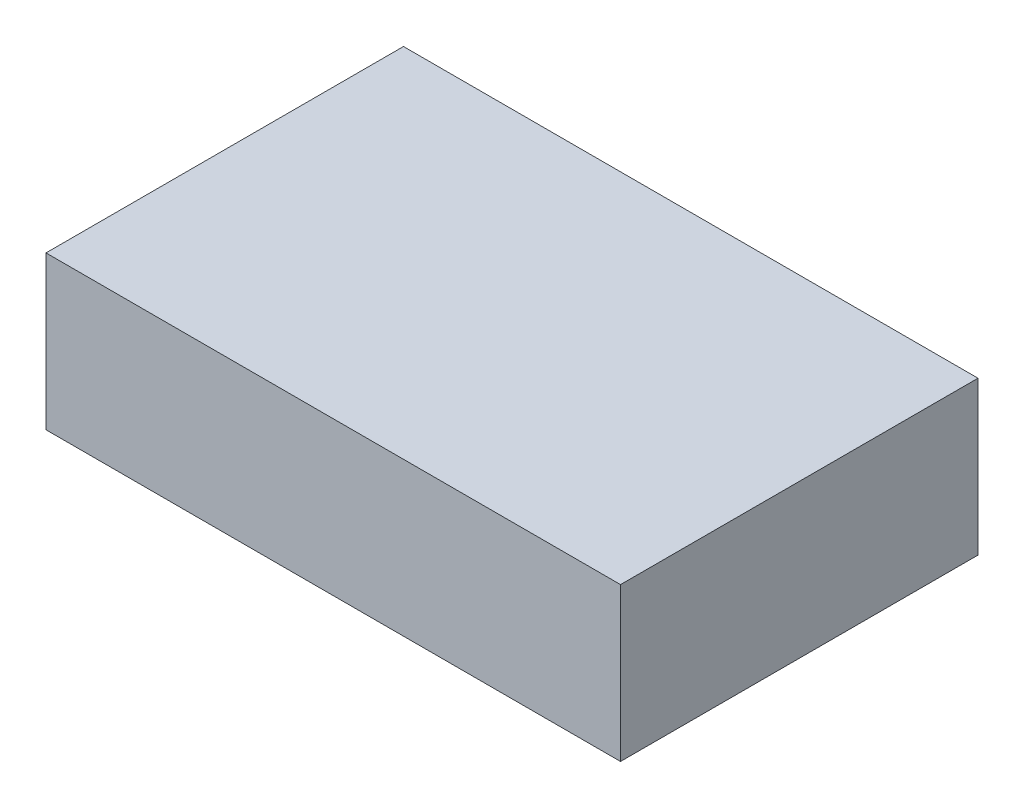
ISO-10303-21;
HEADER;
FILE_DESCRIPTION(('STEP AP214'),'2;1');
FILE_NAME('part.step','',(''),(''),'','','');
FILE_SCHEMA(('AUTOMOTIVE_DESIGN { 1 0 10303 214 1 1 1 1 }'));
ENDSEC;
DATA;
#1=APPLICATION_CONTEXT('core data for automotive mechanical design processes');
#2=APPLICATION_PROTOCOL_DEFINITION('international standard','automotive_design',2000,#1);
#3=PRODUCT_CONTEXT('',#1,'mechanical');
#4=PRODUCT('Part','Part','',(#3));
#5=PRODUCT_RELATED_PRODUCT_CATEGORY('part','',(#4));
#6=PRODUCT_DEFINITION_FORMATION('','',#4);
#7=PRODUCT_DEFINITION_CONTEXT('part definition',#1,'design');
#8=PRODUCT_DEFINITION('design','',#6,#7);
#9=PRODUCT_DEFINITION_SHAPE('','',#8);
#10=(LENGTH_UNIT() NAMED_UNIT(*) SI_UNIT(.MILLI.,.METRE.));
#11=(NAMED_UNIT(*) PLANE_ANGLE_UNIT() SI_UNIT($,.RADIAN.));
#12=(NAMED_UNIT(*) SI_UNIT($,.STERADIAN.) SOLID_ANGLE_UNIT());
#13=UNCERTAINTY_MEASURE_WITH_UNIT(LENGTH_MEASURE(1.E-05),#10,'distance_accuracy_value','');
#14=(GEOMETRIC_REPRESENTATION_CONTEXT(3) GLOBAL_UNCERTAINTY_ASSIGNED_CONTEXT((#13)) GLOBAL_UNIT_ASSIGNED_CONTEXT((#10,
#11,#12)) REPRESENTATION_CONTEXT('',''));
#15=CARTESIAN_POINT('',(0.,0.,0.));
#16=DIRECTION('',(0.,0.,1.));
#17=DIRECTION('',(1.,0.,0.));
#18=AXIS2_PLACEMENT_3D('',#15,#16,#17);
#19=CARTESIAN_POINT('',(45.,24.,-28.));
#20=DIRECTION('',(-1.,0.,0.));
#21=DIRECTION('',(0.,0.,1.));
#22=AXIS2_PLACEMENT_3D('',#19,#20,#21);
#23=PLANE('',#22);
#24=DIRECTION('',(0.,0.,-1.));
#25=VECTOR('',#24,1.);
#26=CARTESIAN_POINT('',(45.,0.,-28.));
#27=LINE('',#26,#25);
#28=CARTESIAN_POINT('',(45.,0.,28.));
#29=VERTEX_POINT('',#28);
#30=CARTESIAN_POINT('',(45.,0.,-28.));
#31=VERTEX_POINT('',#30);
#32=EDGE_CURVE('E101',#29,#31,#27,.T.);
#33=ORIENTED_EDGE('',*,*,#32,.T.);
#34=DIRECTION('',(0.,-1.,0.));
#35=VECTOR('',#34,1.);
#36=CARTESIAN_POINT('',(45.,24.,-28.));
#37=LINE('',#36,#35);
#38=CARTESIAN_POINT('',(45.,24.,-28.));
#39=VERTEX_POINT('',#38);
#40=EDGE_CURVE('E11',#39,#31,#37,.T.);
#41=ORIENTED_EDGE('',*,*,#40,.F.);
#42=DIRECTION('',(0.,0.,-1.));
#43=VECTOR('',#42,1.);
#44=CARTESIAN_POINT('',(45.,24.,-28.));
#45=LINE('',#44,#43);
#46=CARTESIAN_POINT('',(45.,24.,28.));
#47=VERTEX_POINT('',#46);
#48=EDGE_CURVE('E89',#47,#39,#45,.T.);
#49=ORIENTED_EDGE('',*,*,#48,.F.);
#50=DIRECTION('',(0.,-1.,0.));
#51=VECTOR('',#50,1.);
#52=CARTESIAN_POINT('',(45.,24.,28.));
#53=LINE('',#52,#51);
#54=EDGE_CURVE('E97',#47,#29,#53,.T.);
#55=ORIENTED_EDGE('',*,*,#54,.T.);
#56=EDGE_LOOP('',(#33,#41,#49,#55));
#57=FACE_BOUND('',#56,.T.);
#58=ADVANCED_FACE('F38',(#57),#23,.F.);
#59=CARTESIAN_POINT('',(-45.,24.,-28.));
#60=DIRECTION('',(0.,0.,1.));
#61=DIRECTION('',(1.,0.,0.));
#62=AXIS2_PLACEMENT_3D('',#59,#60,#61);
#63=PLANE('',#62);
#64=DIRECTION('',(-1.,0.,0.));
#65=VECTOR('',#64,1.);
#66=CARTESIAN_POINT('',(-45.,0.,-28.));
#67=LINE('',#66,#65);
#68=CARTESIAN_POINT('',(-45.,0.,-28.));
#69=VERTEX_POINT('',#68);
#70=EDGE_CURVE('E93',#31,#69,#67,.T.);
#71=ORIENTED_EDGE('',*,*,#70,.T.);
#72=DIRECTION('',(0.,-1.,0.));
#73=VECTOR('',#72,1.);
#74=CARTESIAN_POINT('',(-45.,24.,-28.));
#75=LINE('',#74,#73);
#76=CARTESIAN_POINT('',(-45.,24.,-28.));
#77=VERTEX_POINT('',#76);
#78=EDGE_CURVE('E46',#77,#69,#75,.T.);
#79=ORIENTED_EDGE('',*,*,#78,.F.);
#80=DIRECTION('',(-1.,0.,0.));
#81=VECTOR('',#80,1.);
#82=CARTESIAN_POINT('',(-45.,24.,-28.));
#83=LINE('',#82,#81);
#84=EDGE_CURVE('E84',#39,#77,#83,.T.);
#85=ORIENTED_EDGE('',*,*,#84,.F.);
#86=ORIENTED_EDGE('',*,*,#40,.T.);
#87=EDGE_LOOP('',(#71,#79,#85,#86));
#88=FACE_BOUND('',#87,.T.);
#89=ADVANCED_FACE('F92',(#88),#63,.F.);
#90=CARTESIAN_POINT('',(-45.,24.,-28.));
#91=DIRECTION('',(1.,0.,0.));
#92=DIRECTION('',(0.,0.,-1.));
#93=AXIS2_PLACEMENT_3D('',#90,#91,#92);
#94=PLANE('',#93);
#95=DIRECTION('',(0.,0.,1.));
#96=VECTOR('',#95,1.);
#97=CARTESIAN_POINT('',(-45.,0.,-28.));
#98=LINE('',#97,#96);
#99=CARTESIAN_POINT('',(-45.,0.,28.));
#100=VERTEX_POINT('',#99);
#101=EDGE_CURVE('E71',#69,#100,#98,.T.);
#102=ORIENTED_EDGE('',*,*,#101,.T.);
#103=DIRECTION('',(0.,-1.,0.));
#104=VECTOR('',#103,1.);
#105=CARTESIAN_POINT('',(-45.,24.,28.));
#106=LINE('',#105,#104);
#107=CARTESIAN_POINT('',(-45.,24.,28.));
#108=VERTEX_POINT('',#107);
#109=EDGE_CURVE('E94',#108,#100,#106,.T.);
#110=ORIENTED_EDGE('',*,*,#109,.F.);
#111=DIRECTION('',(0.,0.,1.));
#112=VECTOR('',#111,1.);
#113=CARTESIAN_POINT('',(-45.,24.,-28.));
#114=LINE('',#113,#112);
#115=EDGE_CURVE('E87',#77,#108,#114,.T.);
#116=ORIENTED_EDGE('',*,*,#115,.F.);
#117=ORIENTED_EDGE('',*,*,#78,.T.);
#118=EDGE_LOOP('',(#102,#110,#116,#117));
#119=FACE_BOUND('',#118,.T.);
#120=ADVANCED_FACE('F95',(#119),#94,.F.);
#121=CARTESIAN_POINT('',(-45.,24.,28.));
#122=DIRECTION('',(0.,0.,-1.));
#123=DIRECTION('',(-1.,0.,0.));
#124=AXIS2_PLACEMENT_3D('',#121,#122,#123);
#125=PLANE('',#124);
#126=DIRECTION('',(1.,0.,0.));
#127=VECTOR('',#126,1.);
#128=CARTESIAN_POINT('',(-45.,0.,28.));
#129=LINE('',#128,#127);
#130=EDGE_CURVE('E77',#100,#29,#129,.T.);
#131=ORIENTED_EDGE('',*,*,#130,.T.);
#132=ORIENTED_EDGE('',*,*,#54,.F.);
#133=DIRECTION('',(1.,0.,0.));
#134=VECTOR('',#133,1.);
#135=CARTESIAN_POINT('',(-45.,24.,28.));
#136=LINE('',#135,#134);
#137=EDGE_CURVE('E54',#108,#47,#136,.T.);
#138=ORIENTED_EDGE('',*,*,#137,.F.);
#139=ORIENTED_EDGE('',*,*,#109,.T.);
#140=EDGE_LOOP('',(#131,#132,#138,#139));
#141=FACE_BOUND('',#140,.T.);
#142=ADVANCED_FACE('F109',(#141),#125,.F.);
#143=CARTESIAN_POINT('',(0.,24.,0.));
#144=DIRECTION('',(0.,1.,0.));
#145=DIRECTION('',(0.,0.,1.));
#146=AXIS2_PLACEMENT_3D('',#143,#144,#145);
#147=PLANE('',#146);
#148=ORIENTED_EDGE('',*,*,#48,.T.);
#149=ORIENTED_EDGE('',*,*,#84,.T.);
#150=ORIENTED_EDGE('',*,*,#115,.T.);
#151=ORIENTED_EDGE('',*,*,#137,.T.);
#152=EDGE_LOOP('',(#148,#149,#150,#151));
#153=FACE_BOUND('',#152,.T.);
#154=ADVANCED_FACE('F85',(#153),#147,.T.);
#155=CARTESIAN_POINT('',(0.,0.,0.));
#156=DIRECTION('',(0.,1.,0.));
#157=DIRECTION('',(0.,0.,1.));
#158=AXIS2_PLACEMENT_3D('',#155,#156,#157);
#159=PLANE('',#158);
#160=CARTESIAN_POINT('',(-42.,0.,-25.));
#161=DIRECTION('',(0.,-1.,0.));
#162=DIRECTION('',(0.,0.,1.));
#163=AXIS2_PLACEMENT_3D('',#160,#161,#162);
#164=CIRCLE('',#163,1.5);
#165=CARTESIAN_POINT('',(-42.,0.,-23.5));
#166=VERTEX_POINT('',#165);
#167=EDGE_CURVE('E121',#166,#166,#164,.T.);
#168=ORIENTED_EDGE('',*,*,#167,.F.);
#169=EDGE_LOOP('',(#168));
#170=FACE_BOUND('',#169,.T.);
#171=CARTESIAN_POINT('',(16.,0.,-25.));
#172=DIRECTION('',(0.,-1.,0.));
#173=DIRECTION('',(0.,0.,1.));
#174=AXIS2_PLACEMENT_3D('',#171,#172,#173);
#175=CIRCLE('',#174,1.5);
#176=CARTESIAN_POINT('',(16.,0.,-23.5));
#177=VERTEX_POINT('',#176);
#178=EDGE_CURVE('E127',#177,#177,#175,.T.);
#179=ORIENTED_EDGE('',*,*,#178,.F.);
#180=EDGE_LOOP('',(#179));
#181=FACE_BOUND('',#180,.T.);
#182=CARTESIAN_POINT('',(16.,0.,25.));
#183=DIRECTION('',(0.,-1.,0.));
#184=DIRECTION('',(0.,0.,-1.));
#185=AXIS2_PLACEMENT_3D('',#182,#183,#184);
#186=CIRCLE('',#185,1.5);
#187=CARTESIAN_POINT('',(16.,0.,23.5));
#188=VERTEX_POINT('',#187);
#189=EDGE_CURVE('E133',#188,#188,#186,.T.);
#190=ORIENTED_EDGE('',*,*,#189,.F.);
#191=EDGE_LOOP('',(#190));
#192=FACE_BOUND('',#191,.T.);
#193=CARTESIAN_POINT('',(-42.,0.,25.));
#194=DIRECTION('',(0.,-1.,0.));
#195=DIRECTION('',(0.,0.,-1.));
#196=AXIS2_PLACEMENT_3D('',#193,#194,#195);
#197=CIRCLE('',#196,1.5);
#198=CARTESIAN_POINT('',(-42.,0.,23.5));
#199=VERTEX_POINT('',#198);
#200=EDGE_CURVE('E115',#199,#199,#197,.T.);
#201=ORIENTED_EDGE('',*,*,#200,.F.);
#202=EDGE_LOOP('',(#201));
#203=FACE_BOUND('',#202,.T.);
#204=ORIENTED_EDGE('',*,*,#32,.F.);
#205=ORIENTED_EDGE('',*,*,#130,.F.);
#206=ORIENTED_EDGE('',*,*,#101,.F.);
#207=ORIENTED_EDGE('',*,*,#70,.F.);
#208=EDGE_LOOP('',(#204,#205,#206,#207));
#209=FACE_BOUND('',#208,.T.);
#210=ADVANCED_FACE('F112',(#170,#181,#192,#203,#209),#159,.F.);
#211=CARTESIAN_POINT('',(-42.,10.,25.));
#212=DIRECTION('',(0.,-1.,0.));
#213=DIRECTION('',(0.,0.,-1.));
#214=AXIS2_PLACEMENT_3D('',#211,#212,#213);
#215=CYLINDRICAL_SURFACE('',#214,1.5);
#216=CARTESIAN_POINT('',(-42.,10.,25.));
#217=DIRECTION('',(0.,-1.,0.));
#218=DIRECTION('',(0.,0.,-1.));
#219=AXIS2_PLACEMENT_3D('',#216,#217,#218);
#220=CIRCLE('',#219,1.5);
#221=CARTESIAN_POINT('',(-42.,10.,23.5));
#222=VERTEX_POINT('',#221);
#223=EDGE_CURVE('E104',#222,#222,#220,.T.);
#224=ORIENTED_EDGE('',*,*,#223,.F.);
#225=EDGE_LOOP('',(#224));
#226=FACE_BOUND('',#225,.T.);
#227=ORIENTED_EDGE('',*,*,#200,.T.);
#228=EDGE_LOOP('',(#227));
#229=FACE_BOUND('',#228,.T.);
#230=ADVANCED_FACE('F150',(#226,#229),#215,.F.);
#231=CARTESIAN_POINT('',(-42.,10.,25.));
#232=DIRECTION('',(0.,-1.,0.));
#233=DIRECTION('',(0.,0.,-1.));
#234=AXIS2_PLACEMENT_3D('',#231,#232,#233);
#235=PLANE('',#234);
#236=ORIENTED_EDGE('',*,*,#223,.T.);
#237=EDGE_LOOP('',(#236));
#238=FACE_BOUND('',#237,.T.);
#239=ADVANCED_FACE('F144',(#238),#235,.T.);
#240=CARTESIAN_POINT('',(16.,10.,25.));
#241=DIRECTION('',(0.,-1.,0.));
#242=DIRECTION('',(0.,0.,-1.));
#243=AXIS2_PLACEMENT_3D('',#240,#241,#242);
#244=CYLINDRICAL_SURFACE('',#243,1.5);
#245=CARTESIAN_POINT('',(16.,10.,25.));
#246=DIRECTION('',(0.,-1.,0.));
#247=DIRECTION('',(0.,0.,-1.));
#248=AXIS2_PLACEMENT_3D('',#245,#246,#247);
#249=CIRCLE('',#248,1.5);
#250=CARTESIAN_POINT('',(16.,10.,23.5));
#251=VERTEX_POINT('',#250);
#252=EDGE_CURVE('E118',#251,#251,#249,.T.);
#253=ORIENTED_EDGE('',*,*,#252,.F.);
#254=EDGE_LOOP('',(#253));
#255=FACE_BOUND('',#254,.T.);
#256=ORIENTED_EDGE('',*,*,#189,.T.);
#257=EDGE_LOOP('',(#256));
#258=FACE_BOUND('',#257,.T.);
#259=ADVANCED_FACE('F141',(#255,#258),#244,.F.);
#260=CARTESIAN_POINT('',(16.,10.,25.));
#261=DIRECTION('',(0.,-1.,0.));
#262=DIRECTION('',(0.,0.,-1.));
#263=AXIS2_PLACEMENT_3D('',#260,#261,#262);
#264=PLANE('',#263);
#265=ORIENTED_EDGE('',*,*,#252,.T.);
#266=EDGE_LOOP('',(#265));
#267=FACE_BOUND('',#266,.T.);
#268=ADVANCED_FACE('F139',(#267),#264,.T.);
#269=CARTESIAN_POINT('',(16.,10.,-25.));
#270=DIRECTION('',(0.,-1.,0.));
#271=DIRECTION('',(0.,0.,-1.));
#272=AXIS2_PLACEMENT_3D('',#269,#270,#271);
#273=CYLINDRICAL_SURFACE('',#272,1.5);
#274=CARTESIAN_POINT('',(16.,10.,-25.));
#275=DIRECTION('',(0.,-1.,0.));
#276=DIRECTION('',(0.,0.,1.));
#277=AXIS2_PLACEMENT_3D('',#274,#275,#276);
#278=CIRCLE('',#277,1.5);
#279=CARTESIAN_POINT('',(16.,10.,-23.5));
#280=VERTEX_POINT('',#279);
#281=EDGE_CURVE('E130',#280,#280,#278,.T.);
#282=ORIENTED_EDGE('',*,*,#281,.F.);
#283=EDGE_LOOP('',(#282));
#284=FACE_BOUND('',#283,.T.);
#285=ORIENTED_EDGE('',*,*,#178,.T.);
#286=EDGE_LOOP('',(#285));
#287=FACE_BOUND('',#286,.T.);
#288=ADVANCED_FACE('F238',(#284,#287),#273,.F.);
#289=CARTESIAN_POINT('',(16.,10.,-25.));
#290=DIRECTION('',(0.,1.,0.));
#291=DIRECTION('',(0.,0.,1.));
#292=AXIS2_PLACEMENT_3D('',#289,#290,#291);
#293=PLANE('',#292);
#294=ORIENTED_EDGE('',*,*,#281,.T.);
#295=EDGE_LOOP('',(#294));
#296=FACE_BOUND('',#295,.T.);
#297=ADVANCED_FACE('F246',(#296),#293,.F.);
#298=CARTESIAN_POINT('',(-42.,10.,-25.));
#299=DIRECTION('',(0.,-1.,0.));
#300=DIRECTION('',(0.,0.,-1.));
#301=AXIS2_PLACEMENT_3D('',#298,#299,#300);
#302=CYLINDRICAL_SURFACE('',#301,1.5);
#303=CARTESIAN_POINT('',(-42.,10.,-25.));
#304=DIRECTION('',(0.,-1.,0.));
#305=DIRECTION('',(0.,0.,1.));
#306=AXIS2_PLACEMENT_3D('',#303,#304,#305);
#307=CIRCLE('',#306,1.5);
#308=CARTESIAN_POINT('',(-42.,10.,-23.5));
#309=VERTEX_POINT('',#308);
#310=EDGE_CURVE('E124',#309,#309,#307,.T.);
#311=ORIENTED_EDGE('',*,*,#310,.F.);
#312=EDGE_LOOP('',(#311));
#313=FACE_BOUND('',#312,.T.);
#314=ORIENTED_EDGE('',*,*,#167,.T.);
#315=EDGE_LOOP('',(#314));
#316=FACE_BOUND('',#315,.T.);
#317=ADVANCED_FACE('F255',(#313,#316),#302,.F.);
#318=CARTESIAN_POINT('',(-42.,10.,-25.));
#319=DIRECTION('',(0.,1.,0.));
#320=DIRECTION('',(0.,0.,1.));
#321=AXIS2_PLACEMENT_3D('',#318,#319,#320);
#322=PLANE('',#321);
#323=ORIENTED_EDGE('',*,*,#310,.T.);
#324=EDGE_LOOP('',(#323));
#325=FACE_BOUND('',#324,.T.);
#326=ADVANCED_FACE('F264',(#325),#322,.F.);
#327=CLOSED_SHELL('',(#58,#89,#120,#142,#154,#210,#230,#239,#259,#268,#288,#297,#317,#326));
#328=MANIFOLD_SOLID_BREP('B2',#327);
#329=ADVANCED_BREP_SHAPE_REPRESENTATION('',(#18,#328),#14);
#330=SHAPE_DEFINITION_REPRESENTATION(#9,#329);
ENDSEC;
END-ISO-10303-21;
